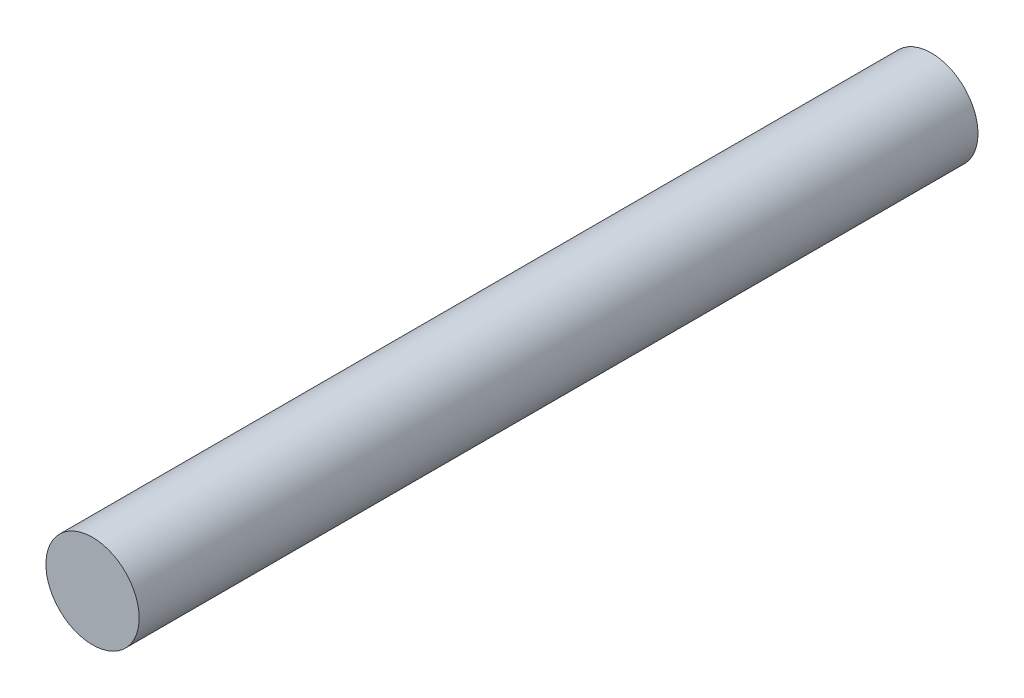
ISO-10303-21;
HEADER;
FILE_DESCRIPTION(('STEP AP214'),'2;1');
FILE_NAME('part.step','',(''),(''),'','','');
FILE_SCHEMA(('AUTOMOTIVE_DESIGN { 1 0 10303 214 1 1 1 1 }'));
ENDSEC;
DATA;
#1=APPLICATION_CONTEXT('core data for automotive mechanical design processes');
#2=APPLICATION_PROTOCOL_DEFINITION('international standard','automotive_design',2000,#1);
#3=PRODUCT_CONTEXT('',#1,'mechanical');
#4=PRODUCT('Part','Part','',(#3));
#5=PRODUCT_RELATED_PRODUCT_CATEGORY('part','',(#4));
#6=PRODUCT_DEFINITION_FORMATION('','',#4);
#7=PRODUCT_DEFINITION_CONTEXT('part definition',#1,'design');
#8=PRODUCT_DEFINITION('design','',#6,#7);
#9=PRODUCT_DEFINITION_SHAPE('','',#8);
#10=(LENGTH_UNIT() NAMED_UNIT(*) SI_UNIT(.MILLI.,.METRE.));
#11=(NAMED_UNIT(*) PLANE_ANGLE_UNIT() SI_UNIT($,.RADIAN.));
#12=(NAMED_UNIT(*) SI_UNIT($,.STERADIAN.) SOLID_ANGLE_UNIT());
#13=UNCERTAINTY_MEASURE_WITH_UNIT(LENGTH_MEASURE(1.E-05),#10,'distance_accuracy_value','');
#14=(GEOMETRIC_REPRESENTATION_CONTEXT(3) GLOBAL_UNCERTAINTY_ASSIGNED_CONTEXT((#13)) GLOBAL_UNIT_ASSIGNED_CONTEXT((#10,
#11,#12)) REPRESENTATION_CONTEXT('',''));
#15=CARTESIAN_POINT('',(0.,0.,0.));
#16=DIRECTION('',(0.,0.,1.));
#17=DIRECTION('',(1.,0.,0.));
#18=AXIS2_PLACEMENT_3D('',#15,#16,#17);
#19=CARTESIAN_POINT('',(3.976,3.899,-9.1));
#20=DIRECTION('',(0.,0.,-1.));
#21=DIRECTION('',(-1.,0.,0.));
#22=AXIS2_PLACEMENT_3D('',#19,#20,#21);
#23=PLANE('',#22);
#24=CARTESIAN_POINT('',(3.675,4.2,-9.1));
#25=DIRECTION('',(0.,0.,1.));
#26=DIRECTION('',(1.,0.,0.));
#27=AXIS2_PLACEMENT_3D('',#24,#25,#26);
#28=CIRCLE('',#27,0.3);
#29=CARTESIAN_POINT('',(3.975,4.2,-9.1));
#30=VERTEX_POINT('',#29);
#31=EDGE_CURVE('E19',#30,#30,#28,.T.);
#32=ORIENTED_EDGE('',*,*,#31,.F.);
#33=EDGE_LOOP('',(#32));
#34=FACE_BOUND('',#33,.T.);
#35=ADVANCED_FACE('F15',(#34),#23,.T.);
#36=CARTESIAN_POINT('',(3.675,4.2,-9.1));
#37=DIRECTION('',(0.,0.,1.));
#38=DIRECTION('',(1.,0.,0.));
#39=AXIS2_PLACEMENT_3D('',#36,#37,#38);
#40=CYLINDRICAL_SURFACE('',#39,0.3);
#41=CARTESIAN_POINT('',(3.675,4.2,-3.7));
#42=DIRECTION('',(0.,0.,1.));
#43=DIRECTION('',(1.,0.,0.));
#44=AXIS2_PLACEMENT_3D('',#41,#42,#43);
#45=CIRCLE('',#44,0.3);
#46=CARTESIAN_POINT('',(3.975,4.2,-3.7));
#47=VERTEX_POINT('',#46);
#48=EDGE_CURVE('E10',#47,#47,#45,.T.);
#49=ORIENTED_EDGE('',*,*,#48,.F.);
#50=EDGE_LOOP('',(#49));
#51=FACE_BOUND('',#50,.T.);
#52=ORIENTED_EDGE('',*,*,#31,.T.);
#53=EDGE_LOOP('',(#52));
#54=FACE_BOUND('',#53,.T.);
#55=ADVANCED_FACE('F28',(#51,#54),#40,.T.);
#56=CARTESIAN_POINT('',(3.976,4.501,-3.7));
#57=DIRECTION('',(0.,0.,1.));
#58=DIRECTION('',(-1.,0.,0.));
#59=AXIS2_PLACEMENT_3D('',#56,#57,#58);
#60=PLANE('',#59);
#61=ORIENTED_EDGE('',*,*,#48,.T.);
#62=EDGE_LOOP('',(#61));
#63=FACE_BOUND('',#62,.T.);
#64=ADVANCED_FACE('F17',(#63),#60,.T.);
#65=CLOSED_SHELL('',(#35,#55,#64));
#66=MANIFOLD_SOLID_BREP('B1',#65);
#67=ADVANCED_BREP_SHAPE_REPRESENTATION('',(#18,#66),#14);
#68=SHAPE_DEFINITION_REPRESENTATION(#9,#67);
ENDSEC;
END-ISO-10303-21;
